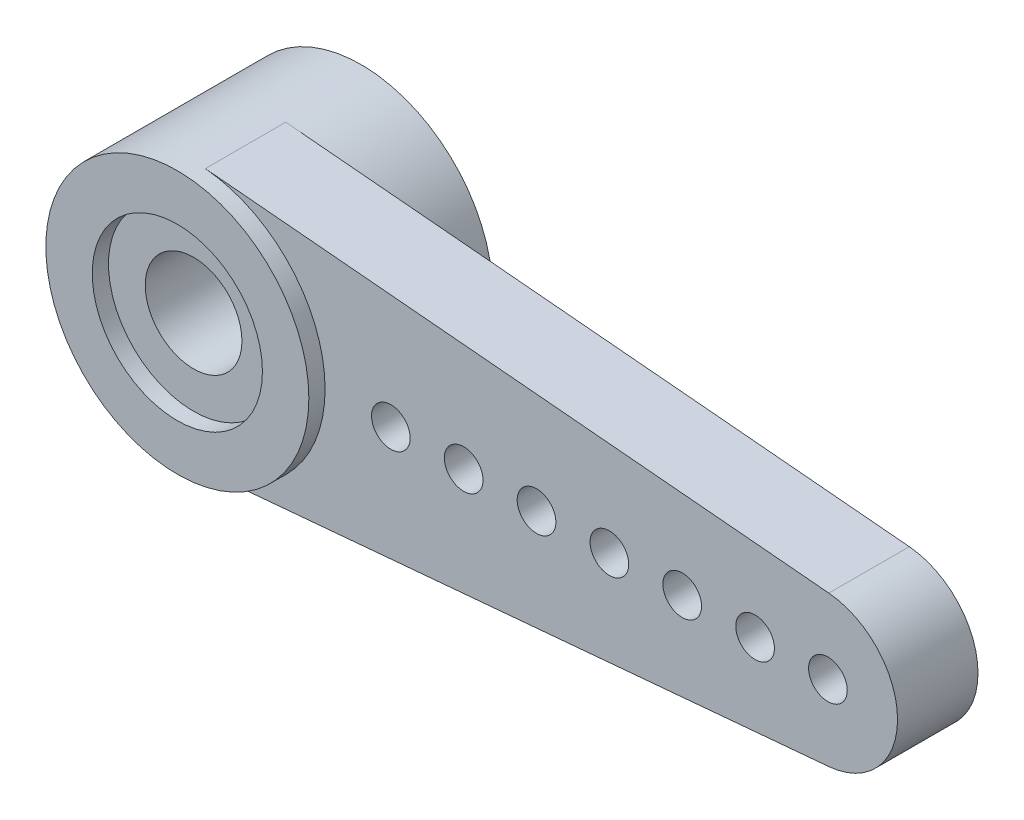
ISO-10303-21;
HEADER;
FILE_DESCRIPTION(('STEP AP214'),'2;1');
FILE_NAME('part.step','',(''),(''),'','','');
FILE_SCHEMA(('AUTOMOTIVE_DESIGN { 1 0 10303 214 1 1 1 1 }'));
ENDSEC;
DATA;
#1=APPLICATION_CONTEXT('core data for automotive mechanical design processes');
#2=APPLICATION_PROTOCOL_DEFINITION('international standard','automotive_design',2000,#1);
#3=PRODUCT_CONTEXT('',#1,'mechanical');
#4=PRODUCT('Part','Part','',(#3));
#5=PRODUCT_RELATED_PRODUCT_CATEGORY('part','',(#4));
#6=PRODUCT_DEFINITION_FORMATION('','',#4);
#7=PRODUCT_DEFINITION_CONTEXT('part definition',#1,'design');
#8=PRODUCT_DEFINITION('design','',#6,#7);
#9=PRODUCT_DEFINITION_SHAPE('','',#8);
#10=(LENGTH_UNIT() NAMED_UNIT(*) SI_UNIT(.MILLI.,.METRE.));
#11=(NAMED_UNIT(*) PLANE_ANGLE_UNIT() SI_UNIT($,.RADIAN.));
#12=(NAMED_UNIT(*) SI_UNIT($,.STERADIAN.) SOLID_ANGLE_UNIT());
#13=UNCERTAINTY_MEASURE_WITH_UNIT(LENGTH_MEASURE(1.E-05),#10,'distance_accuracy_value','');
#14=(GEOMETRIC_REPRESENTATION_CONTEXT(3) GLOBAL_UNCERTAINTY_ASSIGNED_CONTEXT((#13)) GLOBAL_UNIT_ASSIGNED_CONTEXT((#10,
#11,#12)) REPRESENTATION_CONTEXT('',''));
#15=CARTESIAN_POINT('',(0.,0.,0.));
#16=DIRECTION('',(0.,0.,1.));
#17=DIRECTION('',(1.,0.,0.));
#18=AXIS2_PLACEMENT_3D('',#15,#16,#17);
#19=CARTESIAN_POINT('',(0.,0.,2.08));
#20=DIRECTION('',(0.,0.,1.));
#21=DIRECTION('',(1.,0.,0.));
#22=AXIS2_PLACEMENT_3D('',#19,#20,#21);
#23=PLANE('',#22);
#24=CARTESIAN_POINT('',(0.,0.,2.08));
#25=DIRECTION('',(0.,0.,1.));
#26=DIRECTION('',(1.,0.,0.));
#27=AXIS2_PLACEMENT_3D('',#24,#25,#26);
#28=CIRCLE('',#27,1.25);
#29=CARTESIAN_POINT('',(1.25,0.,2.08));
#30=VERTEX_POINT('',#29);
#31=EDGE_CURVE('E113',#30,#30,#28,.T.);
#32=ORIENTED_EDGE('',*,*,#31,.F.);
#33=EDGE_LOOP('',(#32));
#34=FACE_BOUND('',#33,.T.);
#35=CARTESIAN_POINT('',(0.,0.,2.08));
#36=DIRECTION('',(0.,0.,1.));
#37=DIRECTION('',(1.,0.,0.));
#38=AXIS2_PLACEMENT_3D('',#35,#36,#37);
#39=CIRCLE('',#38,2.2);
#40=CARTESIAN_POINT('',(2.2,0.,2.08));
#41=VERTEX_POINT('',#40);
#42=EDGE_CURVE('E157',#41,#41,#39,.T.);
#43=ORIENTED_EDGE('',*,*,#42,.T.);
#44=EDGE_LOOP('',(#43));
#45=FACE_BOUND('',#44,.T.);
#46=ADVANCED_FACE('F56',(#34,#45),#23,.T.);
#47=CARTESIAN_POINT('',(0.,0.,0.));
#48=DIRECTION('',(0.,0.,1.));
#49=DIRECTION('',(1.,0.,0.));
#50=AXIS2_PLACEMENT_3D('',#47,#48,#49);
#51=PLANE('',#50);
#52=CARTESIAN_POINT('',(0.,0.,0.));
#53=DIRECTION('',(0.,0.,1.));
#54=DIRECTION('',(1.,0.,0.));
#55=AXIS2_PLACEMENT_3D('',#52,#53,#54);
#56=CIRCLE('',#55,1.25);
#57=CARTESIAN_POINT('',(1.25,0.,0.));
#58=VERTEX_POINT('',#57);
#59=EDGE_CURVE('E127',#58,#58,#56,.T.);
#60=ORIENTED_EDGE('',*,*,#59,.T.);
#61=EDGE_LOOP('',(#60));
#62=FACE_BOUND('',#61,.T.);
#63=CARTESIAN_POINT('',(0.,0.,0.));
#64=DIRECTION('',(0.,0.,1.));
#65=DIRECTION('',(1.,0.,0.));
#66=AXIS2_PLACEMENT_3D('',#63,#64,#65);
#67=CIRCLE('',#66,2.2);
#68=CARTESIAN_POINT('',(2.2,0.,0.));
#69=VERTEX_POINT('',#68);
#70=EDGE_CURVE('E13',#69,#69,#67,.T.);
#71=ORIENTED_EDGE('',*,*,#70,.F.);
#72=EDGE_LOOP('',(#71));
#73=FACE_BOUND('',#72,.T.);
#74=ADVANCED_FACE('F190',(#62,#73),#51,.F.);
#75=CARTESIAN_POINT('',(0.,0.,2.08));
#76=DIRECTION('',(0.,0.,-1.));
#77=DIRECTION('',(-1.,0.,0.));
#78=AXIS2_PLACEMENT_3D('',#75,#76,#77);
#79=CYLINDRICAL_SURFACE('',#78,1.25);
#80=ORIENTED_EDGE('',*,*,#31,.T.);
#81=EDGE_LOOP('',(#80));
#82=FACE_BOUND('',#81,.T.);
#83=ORIENTED_EDGE('',*,*,#59,.F.);
#84=EDGE_LOOP('',(#83));
#85=FACE_BOUND('',#84,.T.);
#86=ADVANCED_FACE('F197',(#82,#85),#79,.F.);
#87=CARTESIAN_POINT('',(0.,0.,-2.25));
#88=DIRECTION('',(0.,0.,1.));
#89=DIRECTION('',(1.,0.,0.));
#90=AXIS2_PLACEMENT_3D('',#87,#88,#89);
#91=CYLINDRICAL_SURFACE('',#90,2.2);
#92=CARTESIAN_POINT('',(0.,0.,-2.25));
#93=DIRECTION('',(0.,0.,1.));
#94=DIRECTION('',(1.,0.,0.));
#95=AXIS2_PLACEMENT_3D('',#92,#93,#94);
#96=CIRCLE('',#95,2.2);
#97=CARTESIAN_POINT('',(2.2,0.,-2.25));
#98=VERTEX_POINT('',#97);
#99=EDGE_CURVE('E402',#98,#98,#96,.T.);
#100=ORIENTED_EDGE('',*,*,#99,.F.);
#101=EDGE_LOOP('',(#100));
#102=FACE_BOUND('',#101,.T.);
#103=ORIENTED_EDGE('',*,*,#70,.T.);
#104=EDGE_LOOP('',(#103));
#105=FACE_BOUND('',#104,.T.);
#106=ADVANCED_FACE('F241',(#102,#105),#91,.F.);
#107=CARTESIAN_POINT('',(0.,0.,-2.25));
#108=DIRECTION('',(0.,0.,1.));
#109=DIRECTION('',(1.,0.,0.));
#110=AXIS2_PLACEMENT_3D('',#107,#108,#109);
#111=PLANE('',#110);
#112=ORIENTED_EDGE('',*,*,#99,.T.);
#113=EDGE_LOOP('',(#112));
#114=FACE_BOUND('',#113,.T.);
#115=CARTESIAN_POINT('',(0.,0.,-2.25));
#116=DIRECTION('',(0.,0.,1.));
#117=DIRECTION('',(1.,0.,0.));
#118=AXIS2_PLACEMENT_3D('',#115,#116,#117);
#119=CIRCLE('',#118,3.4);
#120=CARTESIAN_POINT('',(3.4,0.,-2.25));
#121=VERTEX_POINT('',#120);
#122=EDGE_CURVE('E405',#121,#121,#119,.T.);
#123=ORIENTED_EDGE('',*,*,#122,.F.);
#124=EDGE_LOOP('',(#123));
#125=FACE_BOUND('',#124,.T.);
#126=ADVANCED_FACE('F281',(#114,#125),#111,.F.);
#127=ORIENTED_EDGE('',*,*,#42,.F.);
#128=EDGE_LOOP('',(#127));
#129=FACE_BOUND('',#128,.T.);
#130=CARTESIAN_POINT('',(0.,0.,2.5));
#131=DIRECTION('',(0.,0.,1.));
#132=DIRECTION('',(1.,0.,0.));
#133=AXIS2_PLACEMENT_3D('',#130,#131,#132);
#134=CIRCLE('',#133,2.2);
#135=CARTESIAN_POINT('',(2.2,0.,2.5));
#136=VERTEX_POINT('',#135);
#137=EDGE_CURVE('E411',#136,#136,#134,.T.);
#138=ORIENTED_EDGE('',*,*,#137,.T.);
#139=EDGE_LOOP('',(#138));
#140=FACE_BOUND('',#139,.T.);
#141=ADVANCED_FACE('F272',(#129,#140),#91,.F.);
#142=CARTESIAN_POINT('',(0.,0.,2.5));
#143=DIRECTION('',(0.,0.,1.));
#144=DIRECTION('',(1.,0.,0.));
#145=AXIS2_PLACEMENT_3D('',#142,#143,#144);
#146=PLANE('',#145);
#147=ORIENTED_EDGE('',*,*,#137,.F.);
#148=EDGE_LOOP('',(#147));
#149=FACE_BOUND('',#148,.T.);
#150=CARTESIAN_POINT('',(0.,0.,2.5));
#151=DIRECTION('',(0.,0.,1.));
#152=DIRECTION('',(1.,0.,0.));
#153=AXIS2_PLACEMENT_3D('',#150,#151,#152);
#154=CIRCLE('',#153,3.4);
#155=CARTESIAN_POINT('',(3.4,0.,2.5));
#156=VERTEX_POINT('',#155);
#157=EDGE_CURVE('E406',#156,#156,#154,.T.);
#158=ORIENTED_EDGE('',*,*,#157,.T.);
#159=EDGE_LOOP('',(#158));
#160=FACE_BOUND('',#159,.T.);
#161=ADVANCED_FACE('F251',(#149,#160),#146,.T.);
#162=CARTESIAN_POINT('',(16.25,0.,2.08));
#163=DIRECTION('',(0.,0.,-1.));
#164=DIRECTION('',(-1.,0.,0.));
#165=AXIS2_PLACEMENT_3D('',#162,#163,#164);
#166=CYLINDRICAL_SURFACE('',#165,1.95);
#167=CARTESIAN_POINT('',(16.25,0.,0.));
#168=DIRECTION('',(0.,0.,1.));
#169=DIRECTION('',(1.,0.,0.));
#170=AXIS2_PLACEMENT_3D('',#167,#168,#169);
#171=CIRCLE('',#170,1.95);
#172=CARTESIAN_POINT('',(16.424,-1.94222140859378,0.));
#173=VERTEX_POINT('',#172);
#174=CARTESIAN_POINT('',(16.424,1.94222140859378,0.));
#175=VERTEX_POINT('',#174);
#176=EDGE_CURVE('E117',#173,#175,#171,.T.);
#177=ORIENTED_EDGE('',*,*,#176,.T.);
#178=DIRECTION('',(0.,0.,-1.));
#179=VECTOR('',#178,1.);
#180=CARTESIAN_POINT('',(16.424,1.94222140859378,2.08));
#181=LINE('',#180,#179);
#182=CARTESIAN_POINT('',(16.424,1.94222140859378,2.08));
#183=VERTEX_POINT('',#182);
#184=EDGE_CURVE('E132',#183,#175,#181,.T.);
#185=ORIENTED_EDGE('',*,*,#184,.F.);
#186=CARTESIAN_POINT('',(16.25,0.,2.08));
#187=DIRECTION('',(0.,0.,1.));
#188=DIRECTION('',(1.,0.,0.));
#189=AXIS2_PLACEMENT_3D('',#186,#187,#188);
#190=CIRCLE('',#189,1.95);
#191=CARTESIAN_POINT('',(16.424,-1.94222140859378,2.08));
#192=VERTEX_POINT('',#191);
#193=EDGE_CURVE('E138',#192,#183,#190,.T.);
#194=ORIENTED_EDGE('',*,*,#193,.F.);
#195=DIRECTION('',(0.,0.,-1.));
#196=VECTOR('',#195,1.);
#197=CARTESIAN_POINT('',(16.424,-1.94222140859378,2.08));
#198=LINE('',#197,#196);
#199=EDGE_CURVE('E98',#192,#173,#198,.T.);
#200=ORIENTED_EDGE('',*,*,#199,.T.);
#201=EDGE_LOOP('',(#177,#185,#194,#200));
#202=FACE_BOUND('',#201,.T.);
#203=ADVANCED_FACE('F135',(#202),#166,.T.);
#204=CARTESIAN_POINT('',(0.303384615384615,3.38643732780454,2.08));
#205=DIRECTION('',(-0.0892307692307693,-0.99601097876604,0.));
#206=DIRECTION('',(0.99601097876604,-0.0892307692307693,0.));
#207=AXIS2_PLACEMENT_3D('',#204,#205,#206);
#208=PLANE('',#207);
#209=DIRECTION('',(-0.99601097876604,0.0892307692307693,0.));
#210=VECTOR('',#209,1.);
#211=CARTESIAN_POINT('',(0.303384615384615,3.38643732780454,0.));
#212=LINE('',#211,#210);
#213=CARTESIAN_POINT('',(0.303384615384616,3.38643732780454,0.));
#214=VERTEX_POINT('',#213);
#215=EDGE_CURVE('E89',#175,#214,#212,.T.);
#216=ORIENTED_EDGE('',*,*,#215,.T.);
#217=DIRECTION('',(0.,0.,-1.));
#218=VECTOR('',#217,1.);
#219=CARTESIAN_POINT('',(0.303384615384616,3.38643732780454,2.08));
#220=LINE('',#219,#218);
#221=CARTESIAN_POINT('',(0.303384615384616,3.38643732780454,2.08));
#222=VERTEX_POINT('',#221);
#223=EDGE_CURVE('E109',#222,#214,#220,.T.);
#224=ORIENTED_EDGE('',*,*,#223,.F.);
#225=DIRECTION('',(-0.99601097876604,0.0892307692307693,0.));
#226=VECTOR('',#225,1.);
#227=CARTESIAN_POINT('',(0.303384615384615,3.38643732780454,2.08));
#228=LINE('',#227,#226);
#229=EDGE_CURVE('E139',#183,#222,#228,.T.);
#230=ORIENTED_EDGE('',*,*,#229,.F.);
#231=ORIENTED_EDGE('',*,*,#184,.T.);
#232=EDGE_LOOP('',(#216,#224,#230,#231));
#233=FACE_BOUND('',#232,.T.);
#234=ADVANCED_FACE('F245',(#233),#208,.F.);
#235=CARTESIAN_POINT('',(0.,0.,2.08));
#236=DIRECTION('',(0.,0.,-1.));
#237=DIRECTION('',(-1.,0.,0.));
#238=AXIS2_PLACEMENT_3D('',#235,#236,#237);
#239=CYLINDRICAL_SURFACE('',#238,3.4);
#240=ORIENTED_EDGE('',*,*,#223,.T.);
#241=CARTESIAN_POINT('',(0.,0.,0.));
#242=DIRECTION('',(0.,0.,1.));
#243=DIRECTION('',(1.,0.,0.));
#244=AXIS2_PLACEMENT_3D('',#241,#242,#243);
#245=CIRCLE('',#244,3.4);
#246=CARTESIAN_POINT('',(0.303384615384615,-3.38643732780453,0.));
#247=VERTEX_POINT('',#246);
#248=EDGE_CURVE('E65',#247,#214,#245,.T.);
#249=ORIENTED_EDGE('',*,*,#248,.F.);
#250=DIRECTION('',(0.,0.,-1.));
#251=VECTOR('',#250,1.);
#252=CARTESIAN_POINT('',(0.303384615384616,-3.38643732780454,2.08));
#253=LINE('',#252,#251);
#254=CARTESIAN_POINT('',(0.303384615384616,-3.38643732780454,2.08));
#255=VERTEX_POINT('',#254);
#256=EDGE_CURVE('E108',#255,#247,#253,.T.);
#257=ORIENTED_EDGE('',*,*,#256,.F.);
#258=CARTESIAN_POINT('',(0.,0.,2.08));
#259=DIRECTION('',(0.,0.,1.));
#260=DIRECTION('',(1.,0.,0.));
#261=AXIS2_PLACEMENT_3D('',#258,#259,#260);
#262=CIRCLE('',#261,3.4);
#263=EDGE_CURVE('E73',#255,#222,#262,.T.);
#264=ORIENTED_EDGE('',*,*,#263,.T.);
#265=EDGE_LOOP('',(#240,#249,#257,#264));
#266=FACE_BOUND('',#265,.T.);
#267=ORIENTED_EDGE('',*,*,#122,.T.);
#268=EDGE_LOOP('',(#267));
#269=FACE_BOUND('',#268,.T.);
#270=ORIENTED_EDGE('',*,*,#157,.F.);
#271=EDGE_LOOP('',(#270));
#272=FACE_BOUND('',#271,.T.);
#273=ADVANCED_FACE('F106',(#266,#269,#272),#239,.T.);
#274=CARTESIAN_POINT('',(0.303384615384616,-3.38643732780454,2.08));
#275=DIRECTION('',(0.0892307692307693,-0.99601097876604,0.));
#276=DIRECTION('',(0.99601097876604,0.0892307692307693,0.));
#277=AXIS2_PLACEMENT_3D('',#274,#275,#276);
#278=PLANE('',#277);
#279=DIRECTION('',(-0.99601097876604,-0.0892307692307693,0.));
#280=VECTOR('',#279,1.);
#281=CARTESIAN_POINT('',(0.303384615384616,-3.38643732780454,0.));
#282=LINE('',#281,#280);
#283=EDGE_CURVE('E111',#173,#247,#282,.T.);
#284=ORIENTED_EDGE('',*,*,#283,.F.);
#285=ORIENTED_EDGE('',*,*,#199,.F.);
#286=DIRECTION('',(-0.99601097876604,-0.0892307692307693,0.));
#287=VECTOR('',#286,1.);
#288=CARTESIAN_POINT('',(0.303384615384616,-3.38643732780454,2.08));
#289=LINE('',#288,#287);
#290=EDGE_CURVE('E112',#192,#255,#289,.T.);
#291=ORIENTED_EDGE('',*,*,#290,.T.);
#292=ORIENTED_EDGE('',*,*,#256,.T.);
#293=EDGE_LOOP('',(#284,#285,#291,#292));
#294=FACE_BOUND('',#293,.T.);
#295=ADVANCED_FACE('F110',(#294),#278,.T.);
#296=CARTESIAN_POINT('',(5.1,0.,2.08));
#297=DIRECTION('',(0.,0.,-1.));
#298=DIRECTION('',(-1.,0.,0.));
#299=AXIS2_PLACEMENT_3D('',#296,#297,#298);
#300=CYLINDRICAL_SURFACE('',#299,0.500000000000001);
#301=CARTESIAN_POINT('',(5.1,0.,2.08));
#302=DIRECTION('',(0.,0.,1.));
#303=DIRECTION('',(1.,0.,0.));
#304=AXIS2_PLACEMENT_3D('',#301,#302,#303);
#305=CIRCLE('',#304,0.500000000000001);
#306=CARTESIAN_POINT('',(5.6,0.,2.08));
#307=VERTEX_POINT('',#306);
#308=EDGE_CURVE('E143',#307,#307,#305,.T.);
#309=ORIENTED_EDGE('',*,*,#308,.T.);
#310=EDGE_LOOP('',(#309));
#311=FACE_BOUND('',#310,.T.);
#312=CARTESIAN_POINT('',(5.1,0.,0.));
#313=DIRECTION('',(0.,0.,1.));
#314=DIRECTION('',(1.,0.,0.));
#315=AXIS2_PLACEMENT_3D('',#312,#313,#314);
#316=CIRCLE('',#315,0.500000000000001);
#317=CARTESIAN_POINT('',(5.6,0.,0.));
#318=VERTEX_POINT('',#317);
#319=EDGE_CURVE('E118',#318,#318,#316,.T.);
#320=ORIENTED_EDGE('',*,*,#319,.F.);
#321=EDGE_LOOP('',(#320));
#322=FACE_BOUND('',#321,.T.);
#323=ADVANCED_FACE('F176',(#311,#322),#300,.F.);
#324=CARTESIAN_POINT('',(6.98333333333333,0.,2.08));
#325=DIRECTION('',(0.,0.,-1.));
#326=DIRECTION('',(-1.,0.,0.));
#327=AXIS2_PLACEMENT_3D('',#324,#325,#326);
#328=CYLINDRICAL_SURFACE('',#327,0.500000000000001);
#329=CARTESIAN_POINT('',(6.98333333333333,0.,2.08));
#330=DIRECTION('',(0.,0.,1.));
#331=DIRECTION('',(1.,0.,0.));
#332=AXIS2_PLACEMENT_3D('',#329,#330,#331);
#333=CIRCLE('',#332,0.500000000000001);
#334=CARTESIAN_POINT('',(7.48333333333333,0.,2.08));
#335=VERTEX_POINT('',#334);
#336=EDGE_CURVE('E146',#335,#335,#333,.T.);
#337=ORIENTED_EDGE('',*,*,#336,.T.);
#338=EDGE_LOOP('',(#337));
#339=FACE_BOUND('',#338,.T.);
#340=CARTESIAN_POINT('',(6.98333333333333,0.,0.));
#341=DIRECTION('',(0.,0.,1.));
#342=DIRECTION('',(1.,0.,0.));
#343=AXIS2_PLACEMENT_3D('',#340,#341,#342);
#344=CIRCLE('',#343,0.500000000000001);
#345=CARTESIAN_POINT('',(7.48333333333333,0.,0.));
#346=VERTEX_POINT('',#345);
#347=EDGE_CURVE('E122',#346,#346,#344,.T.);
#348=ORIENTED_EDGE('',*,*,#347,.F.);
#349=EDGE_LOOP('',(#348));
#350=FACE_BOUND('',#349,.T.);
#351=ADVANCED_FACE('F173',(#339,#350),#328,.F.);
#352=CARTESIAN_POINT('',(8.86666666666667,0.,2.08));
#353=DIRECTION('',(0.,0.,-1.));
#354=DIRECTION('',(-1.,0.,0.));
#355=AXIS2_PLACEMENT_3D('',#352,#353,#354);
#356=CYLINDRICAL_SURFACE('',#355,0.500000000000001);
#357=CARTESIAN_POINT('',(8.86666666666667,0.,2.08));
#358=DIRECTION('',(0.,0.,1.));
#359=DIRECTION('',(1.,0.,0.));
#360=AXIS2_PLACEMENT_3D('',#357,#358,#359);
#361=CIRCLE('',#360,0.500000000000001);
#362=CARTESIAN_POINT('',(9.36666666666667,0.,2.08));
#363=VERTEX_POINT('',#362);
#364=EDGE_CURVE('E426',#363,#363,#361,.T.);
#365=ORIENTED_EDGE('',*,*,#364,.T.);
#366=EDGE_LOOP('',(#365));
#367=FACE_BOUND('',#366,.T.);
#368=CARTESIAN_POINT('',(8.86666666666667,0.,0.));
#369=DIRECTION('',(0.,0.,1.));
#370=DIRECTION('',(1.,0.,0.));
#371=AXIS2_PLACEMENT_3D('',#368,#369,#370);
#372=CIRCLE('',#371,0.500000000000001);
#373=CARTESIAN_POINT('',(9.36666666666667,0.,0.));
#374=VERTEX_POINT('',#373);
#375=EDGE_CURVE('E166',#374,#374,#372,.T.);
#376=ORIENTED_EDGE('',*,*,#375,.F.);
#377=EDGE_LOOP('',(#376));
#378=FACE_BOUND('',#377,.T.);
#379=ADVANCED_FACE('F175',(#367,#378),#356,.F.);
#380=CARTESIAN_POINT('',(10.75,0.,2.08));
#381=DIRECTION('',(0.,0.,-1.));
#382=DIRECTION('',(-1.,0.,0.));
#383=AXIS2_PLACEMENT_3D('',#380,#381,#382);
#384=CYLINDRICAL_SURFACE('',#383,0.500000000000001);
#385=CARTESIAN_POINT('',(10.75,0.,2.08));
#386=DIRECTION('',(0.,0.,1.));
#387=DIRECTION('',(1.,0.,0.));
#388=AXIS2_PLACEMENT_3D('',#385,#386,#387);
#389=CIRCLE('',#388,0.500000000000001);
#390=CARTESIAN_POINT('',(11.25,0.,2.08));
#391=VERTEX_POINT('',#390);
#392=EDGE_CURVE('E229',#391,#391,#389,.T.);
#393=ORIENTED_EDGE('',*,*,#392,.T.);
#394=EDGE_LOOP('',(#393));
#395=FACE_BOUND('',#394,.T.);
#396=CARTESIAN_POINT('',(10.75,0.,0.));
#397=DIRECTION('',(0.,0.,1.));
#398=DIRECTION('',(1.,0.,0.));
#399=AXIS2_PLACEMENT_3D('',#396,#397,#398);
#400=CIRCLE('',#399,0.500000000000001);
#401=CARTESIAN_POINT('',(11.25,0.,0.));
#402=VERTEX_POINT('',#401);
#403=EDGE_CURVE('E163',#402,#402,#400,.T.);
#404=ORIENTED_EDGE('',*,*,#403,.F.);
#405=EDGE_LOOP('',(#404));
#406=FACE_BOUND('',#405,.T.);
#407=ADVANCED_FACE('F183',(#395,#406),#384,.F.);
#408=CARTESIAN_POINT('',(12.6333333333333,0.,2.08));
#409=DIRECTION('',(0.,0.,-1.));
#410=DIRECTION('',(-1.,0.,0.));
#411=AXIS2_PLACEMENT_3D('',#408,#409,#410);
#412=CYLINDRICAL_SURFACE('',#411,0.500000000000001);
#413=CARTESIAN_POINT('',(12.6333333333333,0.,2.08));
#414=DIRECTION('',(0.,0.,1.));
#415=DIRECTION('',(1.,0.,0.));
#416=AXIS2_PLACEMENT_3D('',#413,#414,#415);
#417=CIRCLE('',#416,0.500000000000001);
#418=CARTESIAN_POINT('',(13.1333333333333,0.,2.08));
#419=VERTEX_POINT('',#418);
#420=EDGE_CURVE('E422',#419,#419,#417,.T.);
#421=ORIENTED_EDGE('',*,*,#420,.T.);
#422=EDGE_LOOP('',(#421));
#423=FACE_BOUND('',#422,.T.);
#424=CARTESIAN_POINT('',(12.6333333333333,0.,0.));
#425=DIRECTION('',(0.,0.,1.));
#426=DIRECTION('',(1.,0.,0.));
#427=AXIS2_PLACEMENT_3D('',#424,#425,#426);
#428=CIRCLE('',#427,0.500000000000001);
#429=CARTESIAN_POINT('',(13.1333333333333,0.,0.));
#430=VERTEX_POINT('',#429);
#431=EDGE_CURVE('E160',#430,#430,#428,.T.);
#432=ORIENTED_EDGE('',*,*,#431,.F.);
#433=EDGE_LOOP('',(#432));
#434=FACE_BOUND('',#433,.T.);
#435=ADVANCED_FACE('F212',(#423,#434),#412,.F.);
#436=CARTESIAN_POINT('',(14.5166666666667,0.,2.08));
#437=DIRECTION('',(0.,0.,-1.));
#438=DIRECTION('',(-1.,0.,0.));
#439=AXIS2_PLACEMENT_3D('',#436,#437,#438);
#440=CYLINDRICAL_SURFACE('',#439,0.500000000000001);
#441=CARTESIAN_POINT('',(14.5166666666667,0.,2.08));
#442=DIRECTION('',(0.,0.,1.));
#443=DIRECTION('',(1.,0.,0.));
#444=AXIS2_PLACEMENT_3D('',#441,#442,#443);
#445=CIRCLE('',#444,0.500000000000001);
#446=CARTESIAN_POINT('',(15.0166666666667,0.,2.08));
#447=VERTEX_POINT('',#446);
#448=EDGE_CURVE('E420',#447,#447,#445,.T.);
#449=ORIENTED_EDGE('',*,*,#448,.T.);
#450=EDGE_LOOP('',(#449));
#451=FACE_BOUND('',#450,.T.);
#452=CARTESIAN_POINT('',(14.5166666666667,0.,0.));
#453=DIRECTION('',(0.,0.,1.));
#454=DIRECTION('',(1.,0.,0.));
#455=AXIS2_PLACEMENT_3D('',#452,#453,#454);
#456=CIRCLE('',#455,0.500000000000001);
#457=CARTESIAN_POINT('',(15.0166666666667,0.,0.));
#458=VERTEX_POINT('',#457);
#459=EDGE_CURVE('E156',#458,#458,#456,.T.);
#460=ORIENTED_EDGE('',*,*,#459,.F.);
#461=EDGE_LOOP('',(#460));
#462=FACE_BOUND('',#461,.T.);
#463=ADVANCED_FACE('F204',(#451,#462),#440,.F.);
#464=ORIENTED_EDGE('',*,*,#263,.F.);
#465=ORIENTED_EDGE('',*,*,#290,.F.);
#466=ORIENTED_EDGE('',*,*,#193,.T.);
#467=ORIENTED_EDGE('',*,*,#229,.T.);
#468=EDGE_LOOP('',(#464,#465,#466,#467));
#469=FACE_BOUND('',#468,.T.);
#470=CARTESIAN_POINT('',(16.4,0.,2.08));
#471=DIRECTION('',(0.,0.,1.));
#472=DIRECTION('',(1.,0.,0.));
#473=AXIS2_PLACEMENT_3D('',#470,#471,#472);
#474=CIRCLE('',#473,0.499999999999999);
#475=CARTESIAN_POINT('',(16.9,0.,2.08));
#476=VERTEX_POINT('',#475);
#477=EDGE_CURVE('E129',#476,#476,#474,.T.);
#478=ORIENTED_EDGE('',*,*,#477,.F.);
#479=EDGE_LOOP('',(#478));
#480=FACE_BOUND('',#479,.T.);
#481=ORIENTED_EDGE('',*,*,#448,.F.);
#482=EDGE_LOOP('',(#481));
#483=FACE_BOUND('',#482,.T.);
#484=ORIENTED_EDGE('',*,*,#420,.F.);
#485=EDGE_LOOP('',(#484));
#486=FACE_BOUND('',#485,.T.);
#487=ORIENTED_EDGE('',*,*,#392,.F.);
#488=EDGE_LOOP('',(#487));
#489=FACE_BOUND('',#488,.T.);
#490=ORIENTED_EDGE('',*,*,#364,.F.);
#491=EDGE_LOOP('',(#490));
#492=FACE_BOUND('',#491,.T.);
#493=ORIENTED_EDGE('',*,*,#336,.F.);
#494=EDGE_LOOP('',(#493));
#495=FACE_BOUND('',#494,.T.);
#496=ORIENTED_EDGE('',*,*,#308,.F.);
#497=EDGE_LOOP('',(#496));
#498=FACE_BOUND('',#497,.T.);
#499=ADVANCED_FACE('F141',(#469,#480,#483,#486,#489,#492,#495,#498),#23,.T.);
#500=CARTESIAN_POINT('',(16.4,0.,2.08));
#501=DIRECTION('',(0.,0.,-1.));
#502=DIRECTION('',(-1.,0.,0.));
#503=AXIS2_PLACEMENT_3D('',#500,#501,#502);
#504=CYLINDRICAL_SURFACE('',#503,0.499999999999999);
#505=ORIENTED_EDGE('',*,*,#477,.T.);
#506=EDGE_LOOP('',(#505));
#507=FACE_BOUND('',#506,.T.);
#508=CARTESIAN_POINT('',(16.4,0.,0.));
#509=DIRECTION('',(0.,0.,1.));
#510=DIRECTION('',(1.,0.,0.));
#511=AXIS2_PLACEMENT_3D('',#508,#509,#510);
#512=CIRCLE('',#511,0.499999999999999);
#513=CARTESIAN_POINT('',(16.9,0.,0.));
#514=VERTEX_POINT('',#513);
#515=EDGE_CURVE('E153',#514,#514,#512,.T.);
#516=ORIENTED_EDGE('',*,*,#515,.F.);
#517=EDGE_LOOP('',(#516));
#518=FACE_BOUND('',#517,.T.);
#519=ADVANCED_FACE('F58',(#507,#518),#504,.F.);
#520=ORIENTED_EDGE('',*,*,#515,.T.);
#521=EDGE_LOOP('',(#520));
#522=FACE_BOUND('',#521,.T.);
#523=ORIENTED_EDGE('',*,*,#459,.T.);
#524=EDGE_LOOP('',(#523));
#525=FACE_BOUND('',#524,.T.);
#526=ORIENTED_EDGE('',*,*,#431,.T.);
#527=EDGE_LOOP('',(#526));
#528=FACE_BOUND('',#527,.T.);
#529=ORIENTED_EDGE('',*,*,#403,.T.);
#530=EDGE_LOOP('',(#529));
#531=FACE_BOUND('',#530,.T.);
#532=ORIENTED_EDGE('',*,*,#375,.T.);
#533=EDGE_LOOP('',(#532));
#534=FACE_BOUND('',#533,.T.);
#535=ORIENTED_EDGE('',*,*,#347,.T.);
#536=EDGE_LOOP('',(#535));
#537=FACE_BOUND('',#536,.T.);
#538=ORIENTED_EDGE('',*,*,#319,.T.);
#539=EDGE_LOOP('',(#538));
#540=FACE_BOUND('',#539,.T.);
#541=ORIENTED_EDGE('',*,*,#283,.T.);
#542=ORIENTED_EDGE('',*,*,#248,.T.);
#543=ORIENTED_EDGE('',*,*,#215,.F.);
#544=ORIENTED_EDGE('',*,*,#176,.F.);
#545=EDGE_LOOP('',(#541,#542,#543,#544));
#546=FACE_BOUND('',#545,.T.);
#547=ADVANCED_FACE('F115',(#522,#525,#528,#531,#534,#537,#540,#546),#51,.F.);
#548=CLOSED_SHELL('',(#46,#74,#86,#106,#126,#141,#161,#203,#234,#273,#295,#323,#351,#379,#407,
#435,#463,#499,#519,#547));
#549=MANIFOLD_SOLID_BREP('B2',#548);
#550=ADVANCED_BREP_SHAPE_REPRESENTATION('',(#18,#549),#14);
#551=SHAPE_DEFINITION_REPRESENTATION(#9,#550);
ENDSEC;
END-ISO-10303-21;
